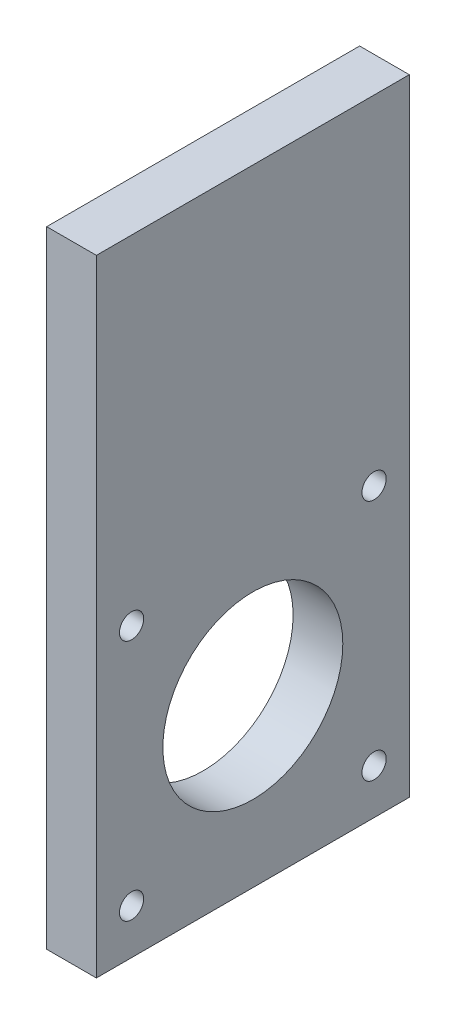
ISO-10303-21;
HEADER;
FILE_DESCRIPTION(('STEP AP214'),'2;1');
FILE_NAME('part.step','',(''),(''),'','','');
FILE_SCHEMA(('AUTOMOTIVE_DESIGN { 1 0 10303 214 1 1 1 1 }'));
ENDSEC;
DATA;
#1=APPLICATION_CONTEXT('core data for automotive mechanical design processes');
#2=APPLICATION_PROTOCOL_DEFINITION('international standard','automotive_design',2000,#1);
#3=PRODUCT_CONTEXT('',#1,'mechanical');
#4=PRODUCT('Part','Part','',(#3));
#5=PRODUCT_RELATED_PRODUCT_CATEGORY('part','',(#4));
#6=PRODUCT_DEFINITION_FORMATION('','',#4);
#7=PRODUCT_DEFINITION_CONTEXT('part definition',#1,'design');
#8=PRODUCT_DEFINITION('design','',#6,#7);
#9=PRODUCT_DEFINITION_SHAPE('','',#8);
#10=(LENGTH_UNIT() NAMED_UNIT(*) SI_UNIT(.MILLI.,.METRE.));
#11=(NAMED_UNIT(*) PLANE_ANGLE_UNIT() SI_UNIT($,.RADIAN.));
#12=(NAMED_UNIT(*) SI_UNIT($,.STERADIAN.) SOLID_ANGLE_UNIT());
#13=UNCERTAINTY_MEASURE_WITH_UNIT(LENGTH_MEASURE(1.E-05),#10,'distance_accuracy_value','');
#14=(GEOMETRIC_REPRESENTATION_CONTEXT(3) GLOBAL_UNCERTAINTY_ASSIGNED_CONTEXT((#13)) GLOBAL_UNIT_ASSIGNED_CONTEXT((#10,
#11,#12)) REPRESENTATION_CONTEXT('',''));
#15=CARTESIAN_POINT('',(0.,0.,0.));
#16=DIRECTION('',(0.,0.,1.));
#17=DIRECTION('',(1.,0.,0.));
#18=AXIS2_PLACEMENT_3D('',#15,#16,#17);
#19=CARTESIAN_POINT('',(6.35,80.,0.));
#20=DIRECTION('',(0.,-1.,0.));
#21=DIRECTION('',(0.,0.,-1.));
#22=AXIS2_PLACEMENT_3D('',#19,#20,#21);
#23=PLANE('',#22);
#24=DIRECTION('',(0.,0.,1.));
#25=VECTOR('',#24,1.);
#26=CARTESIAN_POINT('',(0.,80.,0.));
#27=LINE('',#26,#25);
#28=CARTESIAN_POINT('',(0.,80.,-20.));
#29=VERTEX_POINT('',#28);
#30=CARTESIAN_POINT('',(0.,80.,20.));
#31=VERTEX_POINT('',#30);
#32=EDGE_CURVE('E66',#29,#31,#27,.T.);
#33=ORIENTED_EDGE('',*,*,#32,.T.);
#34=DIRECTION('',(-1.,0.,0.));
#35=VECTOR('',#34,1.);
#36=CARTESIAN_POINT('',(6.35,80.,20.));
#37=LINE('',#36,#35);
#38=CARTESIAN_POINT('',(6.35,80.,20.));
#39=VERTEX_POINT('',#38);
#40=EDGE_CURVE('E46',#39,#31,#37,.T.);
#41=ORIENTED_EDGE('',*,*,#40,.F.);
#42=DIRECTION('',(0.,0.,1.));
#43=VECTOR('',#42,1.);
#44=CARTESIAN_POINT('',(6.35,80.,0.));
#45=LINE('',#44,#43);
#46=CARTESIAN_POINT('',(6.35,80.,-20.));
#47=VERTEX_POINT('',#46);
#48=EDGE_CURVE('E72',#47,#39,#45,.T.);
#49=ORIENTED_EDGE('',*,*,#48,.F.);
#50=DIRECTION('',(-1.,0.,0.));
#51=VECTOR('',#50,1.);
#52=CARTESIAN_POINT('',(6.35,80.,-20.));
#53=LINE('',#52,#51);
#54=EDGE_CURVE('E90',#47,#29,#53,.T.);
#55=ORIENTED_EDGE('',*,*,#54,.T.);
#56=EDGE_LOOP('',(#33,#41,#49,#55));
#57=FACE_BOUND('',#56,.T.);
#58=ADVANCED_FACE('F37',(#57),#23,.F.);
#59=CARTESIAN_POINT('',(6.35,0.,20.));
#60=DIRECTION('',(0.,0.,-1.));
#61=DIRECTION('',(-1.,0.,0.));
#62=AXIS2_PLACEMENT_3D('',#59,#60,#61);
#63=PLANE('',#62);
#64=DIRECTION('',(0.,-1.,0.));
#65=VECTOR('',#64,1.);
#66=CARTESIAN_POINT('',(0.,0.,20.));
#67=LINE('',#66,#65);
#68=CARTESIAN_POINT('',(0.,0.,20.));
#69=VERTEX_POINT('',#68);
#70=EDGE_CURVE('E87',#31,#69,#67,.T.);
#71=ORIENTED_EDGE('',*,*,#70,.T.);
#72=DIRECTION('',(-1.,0.,0.));
#73=VECTOR('',#72,1.);
#74=CARTESIAN_POINT('',(6.35,0.,20.));
#75=LINE('',#74,#73);
#76=CARTESIAN_POINT('',(6.35,0.,20.));
#77=VERTEX_POINT('',#76);
#78=EDGE_CURVE('E121',#77,#69,#75,.T.);
#79=ORIENTED_EDGE('',*,*,#78,.F.);
#80=DIRECTION('',(0.,-1.,0.));
#81=VECTOR('',#80,1.);
#82=CARTESIAN_POINT('',(6.35,0.,20.));
#83=LINE('',#82,#81);
#84=EDGE_CURVE('E55',#39,#77,#83,.T.);
#85=ORIENTED_EDGE('',*,*,#84,.F.);
#86=ORIENTED_EDGE('',*,*,#40,.T.);
#87=EDGE_LOOP('',(#71,#79,#85,#86));
#88=FACE_BOUND('',#87,.T.);
#89=ADVANCED_FACE('F158',(#88),#63,.F.);
#90=CARTESIAN_POINT('',(6.35,0.,0.));
#91=DIRECTION('',(0.,1.,0.));
#92=DIRECTION('',(0.,0.,1.));
#93=AXIS2_PLACEMENT_3D('',#90,#91,#92);
#94=PLANE('',#93);
#95=DIRECTION('',(0.,0.,-1.));
#96=VECTOR('',#95,1.);
#97=CARTESIAN_POINT('',(0.,0.,0.));
#98=LINE('',#97,#96);
#99=CARTESIAN_POINT('',(0.,0.,-20.));
#100=VERTEX_POINT('',#99);
#101=EDGE_CURVE('E118',#69,#100,#98,.T.);
#102=ORIENTED_EDGE('',*,*,#101,.T.);
#103=DIRECTION('',(-1.,0.,0.));
#104=VECTOR('',#103,1.);
#105=CARTESIAN_POINT('',(6.35,0.,-20.));
#106=LINE('',#105,#104);
#107=CARTESIAN_POINT('',(6.35,0.,-20.));
#108=VERTEX_POINT('',#107);
#109=EDGE_CURVE('E94',#108,#100,#106,.T.);
#110=ORIENTED_EDGE('',*,*,#109,.F.);
#111=DIRECTION('',(0.,0.,-1.));
#112=VECTOR('',#111,1.);
#113=CARTESIAN_POINT('',(6.35,0.,0.));
#114=LINE('',#113,#112);
#115=EDGE_CURVE('E120',#77,#108,#114,.T.);
#116=ORIENTED_EDGE('',*,*,#115,.F.);
#117=ORIENTED_EDGE('',*,*,#78,.T.);
#118=EDGE_LOOP('',(#102,#110,#116,#117));
#119=FACE_BOUND('',#118,.T.);
#120=ADVANCED_FACE('F162',(#119),#94,.F.);
#121=CARTESIAN_POINT('',(6.35,0.,0.));
#122=DIRECTION('',(1.,0.,0.));
#123=DIRECTION('',(0.,0.,-1.));
#124=AXIS2_PLACEMENT_3D('',#121,#122,#123);
#125=PLANE('',#124);
#126=CARTESIAN_POINT('',(6.35,5.75,-15.5));
#127=DIRECTION('',(-1.,0.,0.));
#128=DIRECTION('',(0.,0.,1.));
#129=AXIS2_PLACEMENT_3D('',#126,#127,#128);
#130=CIRCLE('',#129,1.54999999999999);
#131=CARTESIAN_POINT('',(6.35,5.75,-13.95));
#132=VERTEX_POINT('',#131);
#133=EDGE_CURVE('E132',#132,#132,#130,.T.);
#134=ORIENTED_EDGE('',*,*,#133,.T.);
#135=EDGE_LOOP('',(#134));
#136=FACE_BOUND('',#135,.T.);
#137=CARTESIAN_POINT('',(6.35,36.75,-15.5));
#138=DIRECTION('',(-1.,0.,0.));
#139=DIRECTION('',(0.,0.,1.));
#140=AXIS2_PLACEMENT_3D('',#137,#138,#139);
#141=CIRCLE('',#140,1.55);
#142=CARTESIAN_POINT('',(6.35,36.75,-13.95));
#143=VERTEX_POINT('',#142);
#144=EDGE_CURVE('E136',#143,#143,#141,.T.);
#145=ORIENTED_EDGE('',*,*,#144,.T.);
#146=EDGE_LOOP('',(#145));
#147=FACE_BOUND('',#146,.T.);
#148=DIRECTION('',(0.,-1.,0.));
#149=VECTOR('',#148,1.);
#150=CARTESIAN_POINT('',(6.35,0.,-20.));
#151=LINE('',#150,#149);
#152=EDGE_CURVE('E95',#47,#108,#151,.T.);
#153=ORIENTED_EDGE('',*,*,#152,.F.);
#154=ORIENTED_EDGE('',*,*,#48,.T.);
#155=ORIENTED_EDGE('',*,*,#84,.T.);
#156=ORIENTED_EDGE('',*,*,#115,.T.);
#157=EDGE_LOOP('',(#153,#154,#155,#156));
#158=FACE_BOUND('',#157,.T.);
#159=CARTESIAN_POINT('',(6.35,21.25,0.));
#160=DIRECTION('',(1.,0.,0.));
#161=DIRECTION('',(0.,0.,-1.));
#162=AXIS2_PLACEMENT_3D('',#159,#160,#161);
#163=CIRCLE('',#162,11.5);
#164=CARTESIAN_POINT('',(6.35,21.25,-11.5));
#165=VERTEX_POINT('',#164);
#166=EDGE_CURVE('E107',#165,#165,#163,.T.);
#167=ORIENTED_EDGE('',*,*,#166,.F.);
#168=EDGE_LOOP('',(#167));
#169=FACE_BOUND('',#168,.T.);
#170=CARTESIAN_POINT('',(6.35,5.75,15.5));
#171=DIRECTION('',(1.,0.,0.));
#172=DIRECTION('',(0.,0.,-1.));
#173=AXIS2_PLACEMENT_3D('',#170,#171,#172);
#174=CIRCLE('',#173,1.54999999999999);
#175=CARTESIAN_POINT('',(6.35,5.75,13.95));
#176=VERTEX_POINT('',#175);
#177=EDGE_CURVE('E111',#176,#176,#174,.T.);
#178=ORIENTED_EDGE('',*,*,#177,.F.);
#179=EDGE_LOOP('',(#178));
#180=FACE_BOUND('',#179,.T.);
#181=CARTESIAN_POINT('',(6.35,36.75,15.5));
#182=DIRECTION('',(1.,0.,0.));
#183=DIRECTION('',(0.,0.,-1.));
#184=AXIS2_PLACEMENT_3D('',#181,#182,#183);
#185=CIRCLE('',#184,1.55);
#186=CARTESIAN_POINT('',(6.35,36.75,13.95));
#187=VERTEX_POINT('',#186);
#188=EDGE_CURVE('E110',#187,#187,#185,.T.);
#189=ORIENTED_EDGE('',*,*,#188,.F.);
#190=EDGE_LOOP('',(#189));
#191=FACE_BOUND('',#190,.T.);
#192=ADVANCED_FACE('F143',(#136,#147,#158,#169,#180,#191),#125,.T.);
#193=CARTESIAN_POINT('',(0.,0.,0.));
#194=DIRECTION('',(1.,0.,0.));
#195=DIRECTION('',(0.,0.,-1.));
#196=AXIS2_PLACEMENT_3D('',#193,#194,#195);
#197=PLANE('',#196);
#198=CARTESIAN_POINT('',(0.,21.25,0.));
#199=DIRECTION('',(1.,0.,0.));
#200=DIRECTION('',(0.,0.,-1.));
#201=AXIS2_PLACEMENT_3D('',#198,#199,#200);
#202=CIRCLE('',#201,11.5);
#203=CARTESIAN_POINT('',(0.,21.25,-11.5));
#204=VERTEX_POINT('',#203);
#205=EDGE_CURVE('E11',#204,#204,#202,.T.);
#206=ORIENTED_EDGE('',*,*,#205,.T.);
#207=EDGE_LOOP('',(#206));
#208=FACE_BOUND('',#207,.T.);
#209=CARTESIAN_POINT('',(0.,5.75,-15.5));
#210=DIRECTION('',(1.,0.,0.));
#211=DIRECTION('',(0.,0.,-1.));
#212=AXIS2_PLACEMENT_3D('',#209,#210,#211);
#213=CIRCLE('',#212,1.54999999999999);
#214=CARTESIAN_POINT('',(0.,5.75,-17.05));
#215=VERTEX_POINT('',#214);
#216=EDGE_CURVE('E40',#215,#215,#213,.F.);
#217=ORIENTED_EDGE('',*,*,#216,.F.);
#218=EDGE_LOOP('',(#217));
#219=FACE_BOUND('',#218,.T.);
#220=CARTESIAN_POINT('',(0.,36.75,-15.5));
#221=DIRECTION('',(1.,0.,0.));
#222=DIRECTION('',(0.,0.,-1.));
#223=AXIS2_PLACEMENT_3D('',#220,#221,#222);
#224=CIRCLE('',#223,1.55);
#225=CARTESIAN_POINT('',(0.,36.75,-17.05));
#226=VERTEX_POINT('',#225);
#227=EDGE_CURVE('E103',#226,#226,#224,.F.);
#228=ORIENTED_EDGE('',*,*,#227,.F.);
#229=EDGE_LOOP('',(#228));
#230=FACE_BOUND('',#229,.T.);
#231=ORIENTED_EDGE('',*,*,#32,.F.);
#232=DIRECTION('',(0.,-1.,0.));
#233=VECTOR('',#232,1.);
#234=CARTESIAN_POINT('',(0.,0.,-20.));
#235=LINE('',#234,#233);
#236=EDGE_CURVE('E86',#29,#100,#235,.T.);
#237=ORIENTED_EDGE('',*,*,#236,.T.);
#238=ORIENTED_EDGE('',*,*,#101,.F.);
#239=ORIENTED_EDGE('',*,*,#70,.F.);
#240=EDGE_LOOP('',(#231,#237,#238,#239));
#241=FACE_BOUND('',#240,.T.);
#242=CARTESIAN_POINT('',(0.,5.75,15.5));
#243=DIRECTION('',(1.,0.,0.));
#244=DIRECTION('',(0.,0.,-1.));
#245=AXIS2_PLACEMENT_3D('',#242,#243,#244);
#246=CIRCLE('',#245,1.54999999999999);
#247=CARTESIAN_POINT('',(0.,5.75,13.95));
#248=VERTEX_POINT('',#247);
#249=EDGE_CURVE('E88',#248,#248,#246,.T.);
#250=ORIENTED_EDGE('',*,*,#249,.T.);
#251=EDGE_LOOP('',(#250));
#252=FACE_BOUND('',#251,.T.);
#253=CARTESIAN_POINT('',(0.,36.75,15.5));
#254=DIRECTION('',(1.,0.,0.));
#255=DIRECTION('',(0.,0.,-1.));
#256=AXIS2_PLACEMENT_3D('',#253,#254,#255);
#257=CIRCLE('',#256,1.55);
#258=CARTESIAN_POINT('',(0.,36.75,13.95));
#259=VERTEX_POINT('',#258);
#260=EDGE_CURVE('E114',#259,#259,#257,.T.);
#261=ORIENTED_EDGE('',*,*,#260,.T.);
#262=EDGE_LOOP('',(#261));
#263=FACE_BOUND('',#262,.T.);
#264=ADVANCED_FACE('F82',(#208,#219,#230,#241,#252,#263),#197,.F.);
#265=CARTESIAN_POINT('',(-3.65,36.75,15.5));
#266=DIRECTION('',(1.,0.,0.));
#267=DIRECTION('',(0.,0.,-1.));
#268=AXIS2_PLACEMENT_3D('',#265,#266,#267);
#269=CYLINDRICAL_SURFACE('',#268,1.55);
#270=ORIENTED_EDGE('',*,*,#188,.T.);
#271=EDGE_LOOP('',(#270));
#272=FACE_BOUND('',#271,.T.);
#273=ORIENTED_EDGE('',*,*,#260,.F.);
#274=EDGE_LOOP('',(#273));
#275=FACE_BOUND('',#274,.T.);
#276=ADVANCED_FACE('F172',(#272,#275),#269,.F.);
#277=CARTESIAN_POINT('',(-3.65,5.75,15.5));
#278=DIRECTION('',(1.,0.,0.));
#279=DIRECTION('',(0.,0.,-1.));
#280=AXIS2_PLACEMENT_3D('',#277,#278,#279);
#281=CYLINDRICAL_SURFACE('',#280,1.54999999999999);
#282=ORIENTED_EDGE('',*,*,#177,.T.);
#283=EDGE_LOOP('',(#282));
#284=FACE_BOUND('',#283,.T.);
#285=ORIENTED_EDGE('',*,*,#249,.F.);
#286=EDGE_LOOP('',(#285));
#287=FACE_BOUND('',#286,.T.);
#288=ADVANCED_FACE('F178',(#284,#287),#281,.F.);
#289=CARTESIAN_POINT('',(-3.65,21.25,0.));
#290=DIRECTION('',(1.,0.,0.));
#291=DIRECTION('',(0.,0.,-1.));
#292=AXIS2_PLACEMENT_3D('',#289,#290,#291);
#293=CYLINDRICAL_SURFACE('',#292,11.5);
#294=ORIENTED_EDGE('',*,*,#166,.T.);
#295=EDGE_LOOP('',(#294));
#296=FACE_BOUND('',#295,.T.);
#297=ORIENTED_EDGE('',*,*,#205,.F.);
#298=EDGE_LOOP('',(#297));
#299=FACE_BOUND('',#298,.T.);
#300=ADVANCED_FACE('F155',(#296,#299),#293,.F.);
#301=CARTESIAN_POINT('',(6.35,0.,-20.));
#302=DIRECTION('',(0.,0.,-1.));
#303=DIRECTION('',(0.,1.,0.));
#304=AXIS2_PLACEMENT_3D('',#301,#302,#303);
#305=PLANE('',#304);
#306=ORIENTED_EDGE('',*,*,#236,.F.);
#307=ORIENTED_EDGE('',*,*,#54,.F.);
#308=ORIENTED_EDGE('',*,*,#152,.T.);
#309=ORIENTED_EDGE('',*,*,#109,.T.);
#310=EDGE_LOOP('',(#306,#307,#308,#309));
#311=FACE_BOUND('',#310,.T.);
#312=ADVANCED_FACE('F98',(#311),#305,.T.);
#313=CARTESIAN_POINT('',(-3.65,36.75,-15.5));
#314=DIRECTION('',(1.,0.,0.));
#315=DIRECTION('',(0.,0.,-1.));
#316=AXIS2_PLACEMENT_3D('',#313,#314,#315);
#317=CYLINDRICAL_SURFACE('',#316,1.55);
#318=ORIENTED_EDGE('',*,*,#144,.F.);
#319=EDGE_LOOP('',(#318));
#320=FACE_BOUND('',#319,.T.);
#321=ORIENTED_EDGE('',*,*,#227,.T.);
#322=EDGE_LOOP('',(#321));
#323=FACE_BOUND('',#322,.T.);
#324=ADVANCED_FACE('F145',(#320,#323),#317,.F.);
#325=CARTESIAN_POINT('',(-3.65,5.75,-15.5));
#326=DIRECTION('',(1.,0.,0.));
#327=DIRECTION('',(0.,0.,-1.));
#328=AXIS2_PLACEMENT_3D('',#325,#326,#327);
#329=CYLINDRICAL_SURFACE('',#328,1.54999999999999);
#330=ORIENTED_EDGE('',*,*,#133,.F.);
#331=EDGE_LOOP('',(#330));
#332=FACE_BOUND('',#331,.T.);
#333=ORIENTED_EDGE('',*,*,#216,.T.);
#334=EDGE_LOOP('',(#333));
#335=FACE_BOUND('',#334,.T.);
#336=ADVANCED_FACE('F147',(#332,#335),#329,.F.);
#337=CLOSED_SHELL('',(#58,#89,#120,#192,#264,#276,#288,#300,#312,#324,#336));
#338=MANIFOLD_SOLID_BREP('B2',#337);
#339=ADVANCED_BREP_SHAPE_REPRESENTATION('',(#18,#338),#14);
#340=SHAPE_DEFINITION_REPRESENTATION(#9,#339);
ENDSEC;
END-ISO-10303-21;
